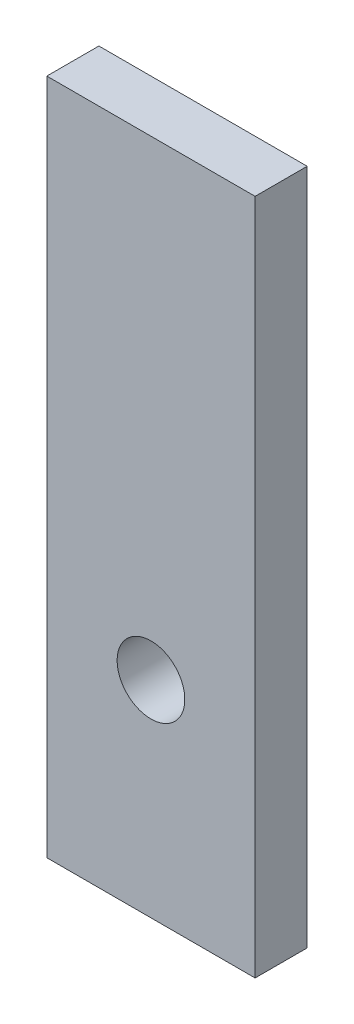
ISO-10303-21;
HEADER;
FILE_DESCRIPTION(('STEP AP214'),'2;1');
FILE_NAME('part.step','',(''),(''),'','','');
FILE_SCHEMA(('AUTOMOTIVE_DESIGN { 1 0 10303 214 1 1 1 1 }'));
ENDSEC;
DATA;
#1=APPLICATION_CONTEXT('core data for automotive mechanical design processes');
#2=APPLICATION_PROTOCOL_DEFINITION('international standard','automotive_design',2000,#1);
#3=PRODUCT_CONTEXT('',#1,'mechanical');
#4=PRODUCT('Part','Part','',(#3));
#5=PRODUCT_RELATED_PRODUCT_CATEGORY('part','',(#4));
#6=PRODUCT_DEFINITION_FORMATION('','',#4);
#7=PRODUCT_DEFINITION_CONTEXT('part definition',#1,'design');
#8=PRODUCT_DEFINITION('design','',#6,#7);
#9=PRODUCT_DEFINITION_SHAPE('','',#8);
#10=(LENGTH_UNIT() NAMED_UNIT(*) SI_UNIT(.MILLI.,.METRE.));
#11=(NAMED_UNIT(*) PLANE_ANGLE_UNIT() SI_UNIT($,.RADIAN.));
#12=(NAMED_UNIT(*) SI_UNIT($,.STERADIAN.) SOLID_ANGLE_UNIT());
#13=UNCERTAINTY_MEASURE_WITH_UNIT(LENGTH_MEASURE(1.E-05),#10,'distance_accuracy_value','');
#14=(GEOMETRIC_REPRESENTATION_CONTEXT(3) GLOBAL_UNCERTAINTY_ASSIGNED_CONTEXT((#13)) GLOBAL_UNIT_ASSIGNED_CONTEXT((#10,
#11,#12)) REPRESENTATION_CONTEXT('',''));
#15=CARTESIAN_POINT('',(0.,0.,0.));
#16=DIRECTION('',(0.,0.,1.));
#17=DIRECTION('',(1.,0.,0.));
#18=AXIS2_PLACEMENT_3D('',#15,#16,#17);
#19=CARTESIAN_POINT('',(-3.00791128946495,-35.5053938067286,1.27));
#20=DIRECTION('',(-1.,0.,0.));
#21=DIRECTION('',(0.,-1.,0.));
#22=AXIS2_PLACEMENT_3D('',#19,#20,#21);
#23=PLANE('',#22);
#24=DIRECTION('',(0.,1.,0.));
#25=VECTOR('',#24,1.);
#26=CARTESIAN_POINT('',(-3.00791128946495,-35.5053938067286,0.));
#27=LINE('',#26,#25);
#28=CARTESIAN_POINT('',(-3.00791128946495,-35.5053938067286,0.));
#29=VERTEX_POINT('',#28);
#30=CARTESIAN_POINT('',(-3.00791128946495,-18.9953938067286,0.));
#31=VERTEX_POINT('',#30);
#32=EDGE_CURVE('E97',#29,#31,#27,.T.);
#33=ORIENTED_EDGE('',*,*,#32,.T.);
#34=DIRECTION('',(0.,0.,-1.));
#35=VECTOR('',#34,1.);
#36=CARTESIAN_POINT('',(-3.00791128946495,-18.9953938067286,1.27));
#37=LINE('',#36,#35);
#38=CARTESIAN_POINT('',(-3.00791128946495,-18.9953938067286,1.27));
#39=VERTEX_POINT('',#38);
#40=EDGE_CURVE('E11',#39,#31,#37,.T.);
#41=ORIENTED_EDGE('',*,*,#40,.F.);
#42=DIRECTION('',(0.,1.,0.));
#43=VECTOR('',#42,1.);
#44=CARTESIAN_POINT('',(-3.00791128946495,-35.5053938067286,1.27));
#45=LINE('',#44,#43);
#46=CARTESIAN_POINT('',(-3.00791128946495,-35.5053938067286,1.27));
#47=VERTEX_POINT('',#46);
#48=EDGE_CURVE('E85',#47,#39,#45,.T.);
#49=ORIENTED_EDGE('',*,*,#48,.F.);
#50=DIRECTION('',(0.,0.,-1.));
#51=VECTOR('',#50,1.);
#52=CARTESIAN_POINT('',(-3.00791128946495,-35.5053938067286,1.27));
#53=LINE('',#52,#51);
#54=EDGE_CURVE('E93',#47,#29,#53,.T.);
#55=ORIENTED_EDGE('',*,*,#54,.T.);
#56=EDGE_LOOP('',(#33,#41,#49,#55));
#57=FACE_BOUND('',#56,.T.);
#58=ADVANCED_FACE('F34',(#57),#23,.F.);
#59=CARTESIAN_POINT('',(-8.08791128946496,-18.9953938067286,1.27));
#60=DIRECTION('',(0.,-1.,0.));
#61=DIRECTION('',(0.,0.,-1.));
#62=AXIS2_PLACEMENT_3D('',#59,#60,#61);
#63=PLANE('',#62);
#64=DIRECTION('',(-1.,0.,0.));
#65=VECTOR('',#64,1.);
#66=CARTESIAN_POINT('',(-8.08791128946496,-18.9953938067286,0.));
#67=LINE('',#66,#65);
#68=CARTESIAN_POINT('',(-8.08791128946496,-18.9953938067286,0.));
#69=VERTEX_POINT('',#68);
#70=EDGE_CURVE('E89',#31,#69,#67,.T.);
#71=ORIENTED_EDGE('',*,*,#70,.T.);
#72=DIRECTION('',(0.,0.,-1.));
#73=VECTOR('',#72,1.);
#74=CARTESIAN_POINT('',(-8.08791128946496,-18.9953938067286,1.27));
#75=LINE('',#74,#73);
#76=CARTESIAN_POINT('',(-8.08791128946496,-18.9953938067286,1.27));
#77=VERTEX_POINT('',#76);
#78=EDGE_CURVE('E42',#77,#69,#75,.T.);
#79=ORIENTED_EDGE('',*,*,#78,.F.);
#80=DIRECTION('',(-1.,0.,0.));
#81=VECTOR('',#80,1.);
#82=CARTESIAN_POINT('',(-8.08791128946496,-18.9953938067286,1.27));
#83=LINE('',#82,#81);
#84=EDGE_CURVE('E80',#39,#77,#83,.T.);
#85=ORIENTED_EDGE('',*,*,#84,.F.);
#86=ORIENTED_EDGE('',*,*,#40,.T.);
#87=EDGE_LOOP('',(#71,#79,#85,#86));
#88=FACE_BOUND('',#87,.T.);
#89=ADVANCED_FACE('F88',(#88),#63,.F.);
#90=CARTESIAN_POINT('',(-8.08791128946496,-35.5053938067286,1.27));
#91=DIRECTION('',(1.,0.,0.));
#92=DIRECTION('',(0.,0.,-1.));
#93=AXIS2_PLACEMENT_3D('',#90,#91,#92);
#94=PLANE('',#93);
#95=DIRECTION('',(0.,-1.,0.));
#96=VECTOR('',#95,1.);
#97=CARTESIAN_POINT('',(-8.08791128946496,-35.5053938067286,0.));
#98=LINE('',#97,#96);
#99=CARTESIAN_POINT('',(-8.08791128946496,-35.5053938067286,0.));
#100=VERTEX_POINT('',#99);
#101=EDGE_CURVE('E67',#69,#100,#98,.T.);
#102=ORIENTED_EDGE('',*,*,#101,.T.);
#103=DIRECTION('',(0.,0.,-1.));
#104=VECTOR('',#103,1.);
#105=CARTESIAN_POINT('',(-8.08791128946496,-35.5053938067286,1.27));
#106=LINE('',#105,#104);
#107=CARTESIAN_POINT('',(-8.08791128946496,-35.5053938067286,1.27));
#108=VERTEX_POINT('',#107);
#109=EDGE_CURVE('E90',#108,#100,#106,.T.);
#110=ORIENTED_EDGE('',*,*,#109,.F.);
#111=DIRECTION('',(0.,-1.,0.));
#112=VECTOR('',#111,1.);
#113=CARTESIAN_POINT('',(-8.08791128946496,-35.5053938067286,1.27));
#114=LINE('',#113,#112);
#115=EDGE_CURVE('E83',#77,#108,#114,.T.);
#116=ORIENTED_EDGE('',*,*,#115,.F.);
#117=ORIENTED_EDGE('',*,*,#78,.T.);
#118=EDGE_LOOP('',(#102,#110,#116,#117));
#119=FACE_BOUND('',#118,.T.);
#120=ADVANCED_FACE('F91',(#119),#94,.F.);
#121=CARTESIAN_POINT('',(-8.08791128946496,-35.5053938067286,1.27));
#122=DIRECTION('',(0.,1.,0.));
#123=DIRECTION('',(0.,0.,1.));
#124=AXIS2_PLACEMENT_3D('',#121,#122,#123);
#125=PLANE('',#124);
#126=DIRECTION('',(1.,0.,0.));
#127=VECTOR('',#126,1.);
#128=CARTESIAN_POINT('',(-8.08791128946496,-35.5053938067286,0.));
#129=LINE('',#128,#127);
#130=EDGE_CURVE('E73',#100,#29,#129,.T.);
#131=ORIENTED_EDGE('',*,*,#130,.T.);
#132=ORIENTED_EDGE('',*,*,#54,.F.);
#133=DIRECTION('',(1.,0.,0.));
#134=VECTOR('',#133,1.);
#135=CARTESIAN_POINT('',(-8.08791128946496,-35.5053938067286,1.27));
#136=LINE('',#135,#134);
#137=EDGE_CURVE('E50',#108,#47,#136,.T.);
#138=ORIENTED_EDGE('',*,*,#137,.F.);
#139=ORIENTED_EDGE('',*,*,#109,.T.);
#140=EDGE_LOOP('',(#131,#132,#138,#139));
#141=FACE_BOUND('',#140,.T.);
#142=ADVANCED_FACE('F105',(#141),#125,.F.);
#143=CARTESIAN_POINT('',(0.,0.,1.27));
#144=DIRECTION('',(0.,0.,-1.));
#145=DIRECTION('',(-1.,0.,0.));
#146=AXIS2_PLACEMENT_3D('',#143,#144,#145);
#147=PLANE('',#146);
#148=CARTESIAN_POINT('',(-5.54791128946495,-30.48,1.27));
#149=DIRECTION('',(0.,0.,-1.));
#150=DIRECTION('',(-1.,0.,0.));
#151=AXIS2_PLACEMENT_3D('',#148,#149,#150);
#152=CIRCLE('',#151,0.825499999999998);
#153=CARTESIAN_POINT('',(-6.37341128946495,-30.48,1.27));
#154=VERTEX_POINT('',#153);
#155=EDGE_CURVE('E100',#154,#154,#152,.T.);
#156=ORIENTED_EDGE('',*,*,#155,.T.);
#157=EDGE_LOOP('',(#156));
#158=FACE_BOUND('',#157,.T.);
#159=ORIENTED_EDGE('',*,*,#48,.T.);
#160=ORIENTED_EDGE('',*,*,#84,.T.);
#161=ORIENTED_EDGE('',*,*,#115,.T.);
#162=ORIENTED_EDGE('',*,*,#137,.T.);
#163=EDGE_LOOP('',(#159,#160,#161,#162));
#164=FACE_BOUND('',#163,.T.);
#165=ADVANCED_FACE('F81',(#158,#164),#147,.F.);
#166=CARTESIAN_POINT('',(0.,0.,0.));
#167=DIRECTION('',(0.,0.,-1.));
#168=DIRECTION('',(-1.,0.,0.));
#169=AXIS2_PLACEMENT_3D('',#166,#167,#168);
#170=PLANE('',#169);
#171=CARTESIAN_POINT('',(-5.54791128946495,-30.48,0.));
#172=DIRECTION('',(0.,0.,-1.));
#173=DIRECTION('',(-1.,0.,0.));
#174=AXIS2_PLACEMENT_3D('',#171,#172,#173);
#175=CIRCLE('',#174,0.825499999999998);
#176=CARTESIAN_POINT('',(-6.37341128946495,-30.48,0.));
#177=VERTEX_POINT('',#176);
#178=EDGE_CURVE('E113',#177,#177,#175,.T.);
#179=ORIENTED_EDGE('',*,*,#178,.F.);
#180=EDGE_LOOP('',(#179));
#181=FACE_BOUND('',#180,.T.);
#182=ORIENTED_EDGE('',*,*,#32,.F.);
#183=ORIENTED_EDGE('',*,*,#130,.F.);
#184=ORIENTED_EDGE('',*,*,#101,.F.);
#185=ORIENTED_EDGE('',*,*,#70,.F.);
#186=EDGE_LOOP('',(#182,#183,#184,#185));
#187=FACE_BOUND('',#186,.T.);
#188=ADVANCED_FACE('F108',(#181,#187),#170,.T.);
#189=CARTESIAN_POINT('',(-5.54791128946495,-30.48,2.54));
#190=DIRECTION('',(0.,0.,-1.));
#191=DIRECTION('',(-1.,0.,0.));
#192=AXIS2_PLACEMENT_3D('',#189,#190,#191);
#193=CYLINDRICAL_SURFACE('',#192,0.825499999999998);
#194=ORIENTED_EDGE('',*,*,#178,.T.);
#195=EDGE_LOOP('',(#194));
#196=FACE_BOUND('',#195,.T.);
#197=ORIENTED_EDGE('',*,*,#155,.F.);
#198=EDGE_LOOP('',(#197));
#199=FACE_BOUND('',#198,.T.);
#200=ADVANCED_FACE('F117',(#196,#199),#193,.F.);
#201=CLOSED_SHELL('',(#58,#89,#120,#142,#165,#188,#200));
#202=MANIFOLD_SOLID_BREP('B2',#201);
#203=ADVANCED_BREP_SHAPE_REPRESENTATION('',(#18,#202),#14);
#204=SHAPE_DEFINITION_REPRESENTATION(#9,#203);
ENDSEC;
END-ISO-10303-21;
